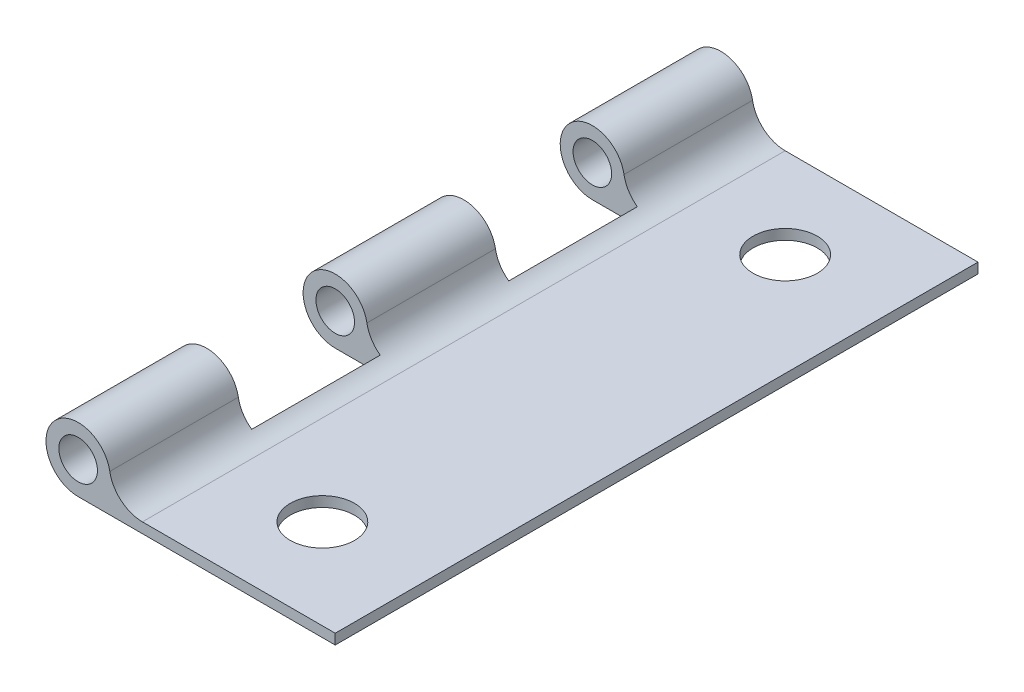
ISO-10303-21;
HEADER;
FILE_DESCRIPTION(('STEP AP214'),'2;1');
FILE_NAME('part.step','',(''),(''),'','','');
FILE_SCHEMA(('AUTOMOTIVE_DESIGN { 1 0 10303 214 1 1 1 1 }'));
ENDSEC;
DATA;
#1=APPLICATION_CONTEXT('core data for automotive mechanical design processes');
#2=APPLICATION_PROTOCOL_DEFINITION('international standard','automotive_design',2000,#1);
#3=PRODUCT_CONTEXT('',#1,'mechanical');
#4=PRODUCT('Part','Part','',(#3));
#5=PRODUCT_RELATED_PRODUCT_CATEGORY('part','',(#4));
#6=PRODUCT_DEFINITION_FORMATION('','',#4);
#7=PRODUCT_DEFINITION_CONTEXT('part definition',#1,'design');
#8=PRODUCT_DEFINITION('design','',#6,#7);
#9=PRODUCT_DEFINITION_SHAPE('','',#8);
#10=(LENGTH_UNIT() NAMED_UNIT(*) SI_UNIT(.MILLI.,.METRE.));
#11=(NAMED_UNIT(*) PLANE_ANGLE_UNIT() SI_UNIT($,.RADIAN.));
#12=(NAMED_UNIT(*) SI_UNIT($,.STERADIAN.) SOLID_ANGLE_UNIT());
#13=UNCERTAINTY_MEASURE_WITH_UNIT(LENGTH_MEASURE(1.E-05),#10,'distance_accuracy_value','');
#14=(GEOMETRIC_REPRESENTATION_CONTEXT(3) GLOBAL_UNCERTAINTY_ASSIGNED_CONTEXT((#13)) GLOBAL_UNIT_ASSIGNED_CONTEXT((#10,
#11,#12)) REPRESENTATION_CONTEXT('',''));
#15=CARTESIAN_POINT('',(0.,0.,0.));
#16=DIRECTION('',(0.,0.,1.));
#17=DIRECTION('',(1.,0.,0.));
#18=AXIS2_PLACEMENT_3D('',#15,#16,#17);
#19=CARTESIAN_POINT('',(-20.,2.50000000000001,50.));
#20=DIRECTION('',(0.,0.,-1.));
#21=DIRECTION('',(-1.,0.,0.));
#22=AXIS2_PLACEMENT_3D('',#19,#20,#21);
#23=CYLINDRICAL_SURFACE('',#22,2.50000000000001);
#24=DIRECTION('',(0.,0.,-1.));
#25=VECTOR('',#24,1.);
#26=CARTESIAN_POINT('',(-20.,0.,50.));
#27=LINE('',#26,#25);
#28=CARTESIAN_POINT('',(-20.,0.,30.));
#29=VERTEX_POINT('',#28);
#30=CARTESIAN_POINT('',(-20.,0.,20.));
#31=VERTEX_POINT('',#30);
#32=EDGE_CURVE('E241',#29,#31,#27,.T.);
#33=ORIENTED_EDGE('',*,*,#32,.F.);
#34=CARTESIAN_POINT('',(-20.,2.50000000000001,30.));
#35=DIRECTION('',(0.,0.,-1.));
#36=DIRECTION('',(-1.,0.,0.));
#37=AXIS2_PLACEMENT_3D('',#34,#35,#36);
#38=CIRCLE('',#37,2.50000000000001);
#39=CARTESIAN_POINT('',(-17.5375234521576,2.93151969981239,30.));
#40=VERTEX_POINT('',#39);
#41=EDGE_CURVE('E188',#29,#40,#38,.T.);
#42=ORIENTED_EDGE('',*,*,#41,.T.);
#43=DIRECTION('',(0.,0.,-1.));
#44=VECTOR('',#43,1.);
#45=CARTESIAN_POINT('',(-17.5375234521576,2.93151969981239,50.));
#46=LINE('',#45,#44);
#47=CARTESIAN_POINT('',(-17.5375234521576,2.93151969981239,20.));
#48=VERTEX_POINT('',#47);
#49=EDGE_CURVE('E245',#40,#48,#46,.T.);
#50=ORIENTED_EDGE('',*,*,#49,.T.);
#51=CARTESIAN_POINT('',(-20.,2.50000000000001,20.));
#52=DIRECTION('',(0.,0.,1.));
#53=DIRECTION('',(1.,0.,0.));
#54=AXIS2_PLACEMENT_3D('',#51,#52,#53);
#55=CIRCLE('',#54,2.50000000000001);
#56=EDGE_CURVE('E179',#48,#31,#55,.T.);
#57=ORIENTED_EDGE('',*,*,#56,.T.);
#58=EDGE_LOOP('',(#33,#42,#50,#57));
#59=FACE_BOUND('',#58,.T.);
#60=ADVANCED_FACE('F33',(#59),#23,.T.);
#61=CARTESIAN_POINT('',(-17.5375234521576,2.93151969981239,50.));
#62=VERTEX_POINT('',#61);
#63=CARTESIAN_POINT('',(-17.5375234521576,2.93151969981239,40.));
#64=VERTEX_POINT('',#63);
#65=EDGE_CURVE('E242',#62,#64,#46,.T.);
#66=ORIENTED_EDGE('',*,*,#65,.T.);
#67=CARTESIAN_POINT('',(-20.,2.50000000000001,40.));
#68=DIRECTION('',(0.,0.,1.));
#69=DIRECTION('',(1.,0.,0.));
#70=AXIS2_PLACEMENT_3D('',#67,#68,#69);
#71=CIRCLE('',#70,2.50000000000001);
#72=CARTESIAN_POINT('',(-20.,0.,40.));
#73=VERTEX_POINT('',#72);
#74=EDGE_CURVE('E185',#64,#73,#71,.T.);
#75=ORIENTED_EDGE('',*,*,#74,.T.);
#76=CARTESIAN_POINT('',(-20.,0.,50.));
#77=VERTEX_POINT('',#76);
#78=EDGE_CURVE('E153',#77,#73,#27,.T.);
#79=ORIENTED_EDGE('',*,*,#78,.F.);
#80=CARTESIAN_POINT('',(-20.,2.50000000000001,50.));
#81=DIRECTION('',(0.,0.,1.));
#82=DIRECTION('',(-1.,0.,0.));
#83=AXIS2_PLACEMENT_3D('',#80,#81,#82);
#84=CIRCLE('',#83,2.5);
#85=EDGE_CURVE('E220',#62,#77,#84,.T.);
#86=ORIENTED_EDGE('',*,*,#85,.F.);
#87=EDGE_LOOP('',(#66,#75,#79,#86));
#88=FACE_BOUND('',#87,.T.);
#89=ADVANCED_FACE('F259',(#88),#23,.T.);
#90=CARTESIAN_POINT('',(-20.,2.50000000000001,50.));
#91=DIRECTION('',(0.,0.,-1.));
#92=DIRECTION('',(-1.,0.,0.));
#93=AXIS2_PLACEMENT_3D('',#90,#91,#92);
#94=CYLINDRICAL_SURFACE('',#93,1.5);
#95=CARTESIAN_POINT('',(-20.,2.50000000000001,40.));
#96=DIRECTION('',(0.,0.,1.));
#97=DIRECTION('',(1.,0.,0.));
#98=AXIS2_PLACEMENT_3D('',#95,#96,#97);
#99=CIRCLE('',#98,1.5);
#100=CARTESIAN_POINT('',(-18.5,2.50000000000001,40.));
#101=VERTEX_POINT('',#100);
#102=EDGE_CURVE('E184',#101,#101,#99,.T.);
#103=ORIENTED_EDGE('',*,*,#102,.F.);
#104=EDGE_LOOP('',(#103));
#105=FACE_BOUND('',#104,.T.);
#106=CARTESIAN_POINT('',(-20.,2.50000000000001,50.));
#107=DIRECTION('',(0.,0.,1.));
#108=DIRECTION('',(1.,0.,0.));
#109=AXIS2_PLACEMENT_3D('',#106,#107,#108);
#110=CIRCLE('',#109,1.5);
#111=CARTESIAN_POINT('',(-18.5,2.50000000000001,50.));
#112=VERTEX_POINT('',#111);
#113=EDGE_CURVE('E206',#112,#112,#110,.T.);
#114=ORIENTED_EDGE('',*,*,#113,.T.);
#115=EDGE_LOOP('',(#114));
#116=FACE_BOUND('',#115,.T.);
#117=ADVANCED_FACE('F255',(#105,#116),#94,.F.);
#118=CARTESIAN_POINT('',(-20.,2.50000000000001,50.));
#119=DIRECTION('',(0.,0.,-1.));
#120=DIRECTION('',(-1.,0.,0.));
#121=AXIS2_PLACEMENT_3D('',#118,#119,#120);
#122=PLANE('',#121);
#123=DIRECTION('',(0.,1.,0.));
#124=VECTOR('',#123,1.);
#125=CARTESIAN_POINT('',(0.,0.799999999999994,50.));
#126=LINE('',#125,#124);
#127=CARTESIAN_POINT('',(0.,0.,50.));
#128=VERTEX_POINT('',#127);
#129=CARTESIAN_POINT('',(0.,0.799999999999994,50.));
#130=VERTEX_POINT('',#129);
#131=EDGE_CURVE('E212',#128,#130,#126,.T.);
#132=ORIENTED_EDGE('',*,*,#131,.T.);
#133=DIRECTION('',(-1.,0.,0.));
#134=VECTOR('',#133,1.);
#135=CARTESIAN_POINT('',(-15.,0.799999999999999,50.));
#136=LINE('',#135,#134);
#137=CARTESIAN_POINT('',(-15.,0.799999999999999,50.));
#138=VERTEX_POINT('',#137);
#139=EDGE_CURVE('E215',#130,#138,#136,.T.);
#140=ORIENTED_EDGE('',*,*,#139,.T.);
#141=CARTESIAN_POINT('',(-15.,3.37619047619047,50.));
#142=DIRECTION('',(0.,0.,-1.));
#143=DIRECTION('',(1.,0.,0.));
#144=AXIS2_PLACEMENT_3D('',#141,#142,#143);
#145=CIRCLE('',#144,2.57619047619047);
#146=EDGE_CURVE('E218',#138,#62,#145,.T.);
#147=ORIENTED_EDGE('',*,*,#146,.T.);
#148=ORIENTED_EDGE('',*,*,#85,.T.);
#149=DIRECTION('',(1.,0.,0.));
#150=VECTOR('',#149,1.);
#151=CARTESIAN_POINT('',(0.,0.,50.));
#152=LINE('',#151,#150);
#153=EDGE_CURVE('E222',#77,#128,#152,.T.);
#154=ORIENTED_EDGE('',*,*,#153,.T.);
#155=EDGE_LOOP('',(#132,#140,#147,#148,#154));
#156=FACE_BOUND('',#155,.T.);
#157=ORIENTED_EDGE('',*,*,#113,.F.);
#158=EDGE_LOOP('',(#157));
#159=FACE_BOUND('',#158,.T.);
#160=ADVANCED_FACE('F258',(#156,#159),#122,.F.);
#161=CARTESIAN_POINT('',(-20.,2.50000000000001,0.));
#162=DIRECTION('',(0.,0.,-1.));
#163=DIRECTION('',(-1.,0.,0.));
#164=AXIS2_PLACEMENT_3D('',#161,#162,#163);
#165=PLANE('',#164);
#166=DIRECTION('',(0.,1.,0.));
#167=VECTOR('',#166,1.);
#168=CARTESIAN_POINT('',(0.,0.799999999999994,0.));
#169=LINE('',#168,#167);
#170=CARTESIAN_POINT('',(0.,0.,0.));
#171=VERTEX_POINT('',#170);
#172=CARTESIAN_POINT('',(0.,0.799999999999994,0.));
#173=VERTEX_POINT('',#172);
#174=EDGE_CURVE('E209',#171,#173,#169,.T.);
#175=ORIENTED_EDGE('',*,*,#174,.F.);
#176=DIRECTION('',(1.,0.,0.));
#177=VECTOR('',#176,1.);
#178=CARTESIAN_POINT('',(0.,0.,0.));
#179=LINE('',#178,#177);
#180=CARTESIAN_POINT('',(-20.,0.,0.));
#181=VERTEX_POINT('',#180);
#182=EDGE_CURVE('E216',#181,#171,#179,.T.);
#183=ORIENTED_EDGE('',*,*,#182,.F.);
#184=CARTESIAN_POINT('',(-20.,2.50000000000001,0.));
#185=DIRECTION('',(0.,0.,1.));
#186=DIRECTION('',(-1.,0.,0.));
#187=AXIS2_PLACEMENT_3D('',#184,#185,#186);
#188=CIRCLE('',#187,2.50000000000001);
#189=CARTESIAN_POINT('',(-17.5375234521576,2.93151969981239,0.));
#190=VERTEX_POINT('',#189);
#191=EDGE_CURVE('E232',#190,#181,#188,.T.);
#192=ORIENTED_EDGE('',*,*,#191,.F.);
#193=CARTESIAN_POINT('',(-15.,3.37619047619047,0.));
#194=DIRECTION('',(0.,0.,-1.));
#195=DIRECTION('',(1.,0.,0.));
#196=AXIS2_PLACEMENT_3D('',#193,#194,#195);
#197=CIRCLE('',#196,2.57619047619047);
#198=CARTESIAN_POINT('',(-15.,0.799999999999999,0.));
#199=VERTEX_POINT('',#198);
#200=EDGE_CURVE('E229',#199,#190,#197,.T.);
#201=ORIENTED_EDGE('',*,*,#200,.F.);
#202=DIRECTION('',(-1.,0.,0.));
#203=VECTOR('',#202,1.);
#204=CARTESIAN_POINT('',(-15.,0.799999999999999,0.));
#205=LINE('',#204,#203);
#206=EDGE_CURVE('E227',#173,#199,#205,.T.);
#207=ORIENTED_EDGE('',*,*,#206,.F.);
#208=EDGE_LOOP('',(#175,#183,#192,#201,#207));
#209=FACE_BOUND('',#208,.T.);
#210=CARTESIAN_POINT('',(-20.,2.50000000000001,0.));
#211=DIRECTION('',(0.,0.,1.));
#212=DIRECTION('',(1.,0.,0.));
#213=AXIS2_PLACEMENT_3D('',#210,#211,#212);
#214=CIRCLE('',#213,1.5);
#215=CARTESIAN_POINT('',(-18.5,2.50000000000001,0.));
#216=VERTEX_POINT('',#215);
#217=EDGE_CURVE('E205',#216,#216,#214,.T.);
#218=ORIENTED_EDGE('',*,*,#217,.T.);
#219=EDGE_LOOP('',(#218));
#220=FACE_BOUND('',#219,.T.);
#221=ADVANCED_FACE('F266',(#209,#220),#165,.T.);
#222=CARTESIAN_POINT('',(0.,0.799999999999994,50.));
#223=DIRECTION('',(-1.,0.,0.));
#224=DIRECTION('',(0.,-1.,0.));
#225=AXIS2_PLACEMENT_3D('',#222,#223,#224);
#226=PLANE('',#225);
#227=ORIENTED_EDGE('',*,*,#174,.T.);
#228=DIRECTION('',(0.,0.,-1.));
#229=VECTOR('',#228,1.);
#230=CARTESIAN_POINT('',(0.,0.799999999999994,50.));
#231=LINE('',#230,#229);
#232=EDGE_CURVE('E11',#130,#173,#231,.T.);
#233=ORIENTED_EDGE('',*,*,#232,.F.);
#234=ORIENTED_EDGE('',*,*,#131,.F.);
#235=DIRECTION('',(0.,0.,-1.));
#236=VECTOR('',#235,1.);
#237=CARTESIAN_POINT('',(0.,0.,50.));
#238=LINE('',#237,#236);
#239=EDGE_CURVE('E224',#128,#171,#238,.T.);
#240=ORIENTED_EDGE('',*,*,#239,.T.);
#241=EDGE_LOOP('',(#227,#233,#234,#240));
#242=FACE_BOUND('',#241,.T.);
#243=ADVANCED_FACE('F35',(#242),#226,.F.);
#244=CARTESIAN_POINT('',(-15.,0.799999999999999,50.));
#245=DIRECTION('',(0.,-1.,0.));
#246=DIRECTION('',(1.,0.,0.));
#247=AXIS2_PLACEMENT_3D('',#244,#245,#246);
#248=PLANE('',#247);
#249=CARTESIAN_POINT('',(-7.99999999999999,0.799999999999997,7.));
#250=DIRECTION('',(0.,-1.,0.));
#251=DIRECTION('',(1.,0.,0.));
#252=AXIS2_PLACEMENT_3D('',#249,#250,#251);
#253=CIRCLE('',#252,2.5);
#254=CARTESIAN_POINT('',(-5.49999999999999,0.799999999999996,7.));
#255=VERTEX_POINT('',#254);
#256=EDGE_CURVE('E202',#255,#255,#253,.T.);
#257=ORIENTED_EDGE('',*,*,#256,.T.);
#258=EDGE_LOOP('',(#257));
#259=FACE_BOUND('',#258,.T.);
#260=CARTESIAN_POINT('',(-8.,0.799999999999997,43.));
#261=DIRECTION('',(0.,-1.,0.));
#262=DIRECTION('',(1.,0.,0.));
#263=AXIS2_PLACEMENT_3D('',#260,#261,#262);
#264=CIRCLE('',#263,2.5);
#265=CARTESIAN_POINT('',(-5.5,0.799999999999996,43.));
#266=VERTEX_POINT('',#265);
#267=EDGE_CURVE('E197',#266,#266,#264,.T.);
#268=ORIENTED_EDGE('',*,*,#267,.T.);
#269=EDGE_LOOP('',(#268));
#270=FACE_BOUND('',#269,.T.);
#271=ORIENTED_EDGE('',*,*,#206,.T.);
#272=DIRECTION('',(0.,0.,-1.));
#273=VECTOR('',#272,1.);
#274=CARTESIAN_POINT('',(-15.,0.799999999999999,50.));
#275=LINE('',#274,#273);
#276=EDGE_CURVE('E42',#138,#199,#275,.T.);
#277=ORIENTED_EDGE('',*,*,#276,.F.);
#278=ORIENTED_EDGE('',*,*,#139,.F.);
#279=ORIENTED_EDGE('',*,*,#232,.T.);
#280=EDGE_LOOP('',(#271,#277,#278,#279));
#281=FACE_BOUND('',#280,.T.);
#282=ADVANCED_FACE('F293',(#259,#270,#281),#248,.F.);
#283=CARTESIAN_POINT('',(-15.,3.37619047619047,50.));
#284=DIRECTION('',(0.,0.,-1.));
#285=DIRECTION('',(-1.,0.,0.));
#286=AXIS2_PLACEMENT_3D('',#283,#284,#285);
#287=CYLINDRICAL_SURFACE('',#286,2.57619047619047);
#288=ORIENTED_EDGE('',*,*,#49,.F.);
#289=CARTESIAN_POINT('',(-15.,3.37619047619047,30.));
#290=DIRECTION('',(0.,0.,-1.));
#291=DIRECTION('',(-1.,0.,0.));
#292=AXIS2_PLACEMENT_3D('',#289,#290,#291);
#293=CIRCLE('',#292,2.57619047619047);
#294=CARTESIAN_POINT('',(-16.5,1.28173174668194,30.));
#295=VERTEX_POINT('',#294);
#296=EDGE_CURVE('E191',#40,#295,#293,.F.);
#297=ORIENTED_EDGE('',*,*,#296,.T.);
#298=DIRECTION('',(0.,0.,-1.));
#299=VECTOR('',#298,1.);
#300=CARTESIAN_POINT('',(-16.5,1.28173174668194,50.));
#301=LINE('',#300,#299);
#302=CARTESIAN_POINT('',(-16.5,1.28173174668194,40.));
#303=VERTEX_POINT('',#302);
#304=EDGE_CURVE('E200',#295,#303,#301,.F.);
#305=ORIENTED_EDGE('',*,*,#304,.T.);
#306=CARTESIAN_POINT('',(-15.,3.37619047619047,40.));
#307=DIRECTION('',(0.,0.,1.));
#308=DIRECTION('',(1.,0.,0.));
#309=AXIS2_PLACEMENT_3D('',#306,#307,#308);
#310=CIRCLE('',#309,2.57619047619047);
#311=EDGE_CURVE('E139',#303,#64,#310,.F.);
#312=ORIENTED_EDGE('',*,*,#311,.T.);
#313=ORIENTED_EDGE('',*,*,#65,.F.);
#314=ORIENTED_EDGE('',*,*,#146,.F.);
#315=ORIENTED_EDGE('',*,*,#276,.T.);
#316=ORIENTED_EDGE('',*,*,#200,.T.);
#317=CARTESIAN_POINT('',(-17.5375234521576,2.93151969981239,10.));
#318=VERTEX_POINT('',#317);
#319=EDGE_CURVE('E240',#318,#190,#46,.T.);
#320=ORIENTED_EDGE('',*,*,#319,.F.);
#321=CARTESIAN_POINT('',(-15.,3.37619047619047,10.));
#322=DIRECTION('',(0.,0.,-1.));
#323=DIRECTION('',(-1.,0.,0.));
#324=AXIS2_PLACEMENT_3D('',#321,#322,#323);
#325=CIRCLE('',#324,2.57619047619047);
#326=CARTESIAN_POINT('',(-16.5,1.28173174668194,10.));
#327=VERTEX_POINT('',#326);
#328=EDGE_CURVE('E175',#318,#327,#325,.F.);
#329=ORIENTED_EDGE('',*,*,#328,.T.);
#330=DIRECTION('',(0.,0.,-1.));
#331=VECTOR('',#330,1.);
#332=CARTESIAN_POINT('',(-16.5,1.28173174668194,50.));
#333=LINE('',#332,#331);
#334=CARTESIAN_POINT('',(-16.5,1.28173174668194,20.));
#335=VERTEX_POINT('',#334);
#336=EDGE_CURVE('E194',#327,#335,#333,.F.);
#337=ORIENTED_EDGE('',*,*,#336,.T.);
#338=CARTESIAN_POINT('',(-15.,3.37619047619047,20.));
#339=DIRECTION('',(0.,0.,1.));
#340=DIRECTION('',(1.,0.,0.));
#341=AXIS2_PLACEMENT_3D('',#338,#339,#340);
#342=CIRCLE('',#341,2.57619047619047);
#343=EDGE_CURVE('E181',#335,#48,#342,.F.);
#344=ORIENTED_EDGE('',*,*,#343,.T.);
#345=EDGE_LOOP('',(#288,#297,#305,#312,#313,#314,#315,#316,#320,#329,#337,#344));
#346=FACE_BOUND('',#345,.T.);
#347=ADVANCED_FACE('F286',(#346),#287,.F.);
#348=CARTESIAN_POINT('',(-20.,0.,10.));
#349=VERTEX_POINT('',#348);
#350=EDGE_CURVE('E238',#349,#181,#27,.T.);
#351=ORIENTED_EDGE('',*,*,#350,.F.);
#352=CARTESIAN_POINT('',(-20.,2.50000000000001,10.));
#353=DIRECTION('',(0.,0.,-1.));
#354=DIRECTION('',(-1.,0.,0.));
#355=AXIS2_PLACEMENT_3D('',#352,#353,#354);
#356=CIRCLE('',#355,2.50000000000001);
#357=EDGE_CURVE('E58',#349,#318,#356,.T.);
#358=ORIENTED_EDGE('',*,*,#357,.T.);
#359=ORIENTED_EDGE('',*,*,#319,.T.);
#360=ORIENTED_EDGE('',*,*,#191,.T.);
#361=EDGE_LOOP('',(#351,#358,#359,#360));
#362=FACE_BOUND('',#361,.T.);
#363=ADVANCED_FACE('F277',(#362),#23,.T.);
#364=CARTESIAN_POINT('',(0.,0.,50.));
#365=DIRECTION('',(0.,1.,0.));
#366=DIRECTION('',(-1.,0.,0.));
#367=AXIS2_PLACEMENT_3D('',#364,#365,#366);
#368=PLANE('',#367);
#369=CARTESIAN_POINT('',(-7.99999999999999,0.,7.));
#370=DIRECTION('',(0.,-1.,0.));
#371=DIRECTION('',(-1.,0.,0.));
#372=AXIS2_PLACEMENT_3D('',#369,#370,#371);
#373=CIRCLE('',#372,2.5);
#374=CARTESIAN_POINT('',(-10.5,0.,7.));
#375=VERTEX_POINT('',#374);
#376=EDGE_CURVE('E158',#375,#375,#373,.T.);
#377=ORIENTED_EDGE('',*,*,#376,.F.);
#378=EDGE_LOOP('',(#377));
#379=FACE_BOUND('',#378,.T.);
#380=CARTESIAN_POINT('',(-8.,0.,43.));
#381=DIRECTION('',(0.,-1.,0.));
#382=DIRECTION('',(1.,0.,0.));
#383=AXIS2_PLACEMENT_3D('',#380,#381,#382);
#384=CIRCLE('',#383,2.5);
#385=CARTESIAN_POINT('',(-5.5,0.,43.));
#386=VERTEX_POINT('',#385);
#387=EDGE_CURVE('E142',#386,#386,#384,.T.);
#388=ORIENTED_EDGE('',*,*,#387,.F.);
#389=EDGE_LOOP('',(#388));
#390=FACE_BOUND('',#389,.T.);
#391=DIRECTION('',(0.,0.,1.));
#392=VECTOR('',#391,1.);
#393=CARTESIAN_POINT('',(-16.5,0.,30.));
#394=LINE('',#393,#392);
#395=CARTESIAN_POINT('',(-16.5,0.,30.));
#396=VERTEX_POINT('',#395);
#397=CARTESIAN_POINT('',(-16.5,0.,40.));
#398=VERTEX_POINT('',#397);
#399=EDGE_CURVE('E146',#396,#398,#394,.T.);
#400=ORIENTED_EDGE('',*,*,#399,.F.);
#401=DIRECTION('',(1.,0.,0.));
#402=VECTOR('',#401,1.);
#403=CARTESIAN_POINT('',(-22.5,0.,30.));
#404=LINE('',#403,#402);
#405=EDGE_CURVE('E50',#29,#396,#404,.T.);
#406=ORIENTED_EDGE('',*,*,#405,.F.);
#407=ORIENTED_EDGE('',*,*,#32,.T.);
#408=DIRECTION('',(-1.,0.,0.));
#409=VECTOR('',#408,1.);
#410=CARTESIAN_POINT('',(-22.5,0.,20.));
#411=LINE('',#410,#409);
#412=CARTESIAN_POINT('',(-16.5,0.,20.));
#413=VERTEX_POINT('',#412);
#414=EDGE_CURVE('E166',#413,#31,#411,.T.);
#415=ORIENTED_EDGE('',*,*,#414,.F.);
#416=DIRECTION('',(0.,0.,1.));
#417=VECTOR('',#416,1.);
#418=CARTESIAN_POINT('',(-16.5,0.,10.));
#419=LINE('',#418,#417);
#420=CARTESIAN_POINT('',(-16.5,0.,10.));
#421=VERTEX_POINT('',#420);
#422=EDGE_CURVE('E163',#421,#413,#419,.T.);
#423=ORIENTED_EDGE('',*,*,#422,.F.);
#424=DIRECTION('',(1.,0.,0.));
#425=VECTOR('',#424,1.);
#426=CARTESIAN_POINT('',(-22.5,0.,10.));
#427=LINE('',#426,#425);
#428=EDGE_CURVE('E161',#349,#421,#427,.T.);
#429=ORIENTED_EDGE('',*,*,#428,.F.);
#430=ORIENTED_EDGE('',*,*,#350,.T.);
#431=ORIENTED_EDGE('',*,*,#182,.T.);
#432=ORIENTED_EDGE('',*,*,#239,.F.);
#433=ORIENTED_EDGE('',*,*,#153,.F.);
#434=ORIENTED_EDGE('',*,*,#78,.T.);
#435=DIRECTION('',(-1.,0.,0.));
#436=VECTOR('',#435,1.);
#437=CARTESIAN_POINT('',(-22.5,0.,40.));
#438=LINE('',#437,#436);
#439=EDGE_CURVE('E136',#398,#73,#438,.T.);
#440=ORIENTED_EDGE('',*,*,#439,.F.);
#441=EDGE_LOOP('',(#400,#406,#407,#415,#423,#429,#430,#431,#432,#433,#434,#440));
#442=FACE_BOUND('',#441,.T.);
#443=ADVANCED_FACE('F150',(#379,#390,#442),#368,.F.);
#444=CARTESIAN_POINT('',(-20.,2.50000000000001,10.));
#445=DIRECTION('',(0.,0.,-1.));
#446=DIRECTION('',(-1.,0.,0.));
#447=AXIS2_PLACEMENT_3D('',#444,#445,#446);
#448=CIRCLE('',#447,1.5);
#449=CARTESIAN_POINT('',(-21.5,2.50000000000001,10.));
#450=VERTEX_POINT('',#449);
#451=EDGE_CURVE('E172',#450,#450,#448,.T.);
#452=ORIENTED_EDGE('',*,*,#451,.F.);
#453=EDGE_LOOP('',(#452));
#454=FACE_BOUND('',#453,.T.);
#455=ORIENTED_EDGE('',*,*,#217,.F.);
#456=EDGE_LOOP('',(#455));
#457=FACE_BOUND('',#456,.T.);
#458=ADVANCED_FACE('F261',(#454,#457),#94,.F.);
#459=CARTESIAN_POINT('',(-16.5,5.00000000000002,10.));
#460=DIRECTION('',(1.,0.,0.));
#461=DIRECTION('',(0.,1.,0.));
#462=AXIS2_PLACEMENT_3D('',#459,#460,#461);
#463=PLANE('',#462);
#464=DIRECTION('',(0.,-1.,0.));
#465=VECTOR('',#464,1.);
#466=CARTESIAN_POINT('',(-16.5,5.00000000000002,10.));
#467=LINE('',#466,#465);
#468=EDGE_CURVE('E169',#327,#421,#467,.T.);
#469=ORIENTED_EDGE('',*,*,#468,.T.);
#470=ORIENTED_EDGE('',*,*,#422,.T.);
#471=DIRECTION('',(0.,-1.,0.));
#472=VECTOR('',#471,1.);
#473=CARTESIAN_POINT('',(-16.5,5.00000000000002,20.));
#474=LINE('',#473,#472);
#475=EDGE_CURVE('E170',#335,#413,#474,.T.);
#476=ORIENTED_EDGE('',*,*,#475,.F.);
#477=ORIENTED_EDGE('',*,*,#336,.F.);
#478=EDGE_LOOP('',(#469,#470,#476,#477));
#479=FACE_BOUND('',#478,.T.);
#480=ADVANCED_FACE('F308',(#479),#463,.F.);
#481=CARTESIAN_POINT('',(-22.5,5.00000000000002,20.));
#482=DIRECTION('',(0.,0.,1.));
#483=DIRECTION('',(1.,0.,0.));
#484=AXIS2_PLACEMENT_3D('',#481,#482,#483);
#485=PLANE('',#484);
#486=CARTESIAN_POINT('',(-20.,2.50000000000001,20.));
#487=DIRECTION('',(0.,0.,1.));
#488=DIRECTION('',(1.,0.,0.));
#489=AXIS2_PLACEMENT_3D('',#486,#487,#488);
#490=CIRCLE('',#489,1.5);
#491=CARTESIAN_POINT('',(-18.5,2.50000000000001,20.));
#492=VERTEX_POINT('',#491);
#493=EDGE_CURVE('E178',#492,#492,#490,.T.);
#494=ORIENTED_EDGE('',*,*,#493,.T.);
#495=EDGE_LOOP('',(#494));
#496=FACE_BOUND('',#495,.T.);
#497=ORIENTED_EDGE('',*,*,#56,.F.);
#498=ORIENTED_EDGE('',*,*,#343,.F.);
#499=ORIENTED_EDGE('',*,*,#475,.T.);
#500=ORIENTED_EDGE('',*,*,#414,.T.);
#501=EDGE_LOOP('',(#497,#498,#499,#500));
#502=FACE_BOUND('',#501,.T.);
#503=ADVANCED_FACE('F305',(#496,#502),#485,.F.);
#504=CARTESIAN_POINT('',(-22.5,5.00000000000002,10.));
#505=DIRECTION('',(0.,0.,-1.));
#506=DIRECTION('',(-1.,0.,0.));
#507=AXIS2_PLACEMENT_3D('',#504,#505,#506);
#508=PLANE('',#507);
#509=ORIENTED_EDGE('',*,*,#451,.T.);
#510=EDGE_LOOP('',(#509));
#511=FACE_BOUND('',#510,.T.);
#512=ORIENTED_EDGE('',*,*,#357,.F.);
#513=ORIENTED_EDGE('',*,*,#428,.T.);
#514=ORIENTED_EDGE('',*,*,#468,.F.);
#515=ORIENTED_EDGE('',*,*,#328,.F.);
#516=EDGE_LOOP('',(#512,#513,#514,#515));
#517=FACE_BOUND('',#516,.T.);
#518=ADVANCED_FACE('F310',(#511,#517),#508,.F.);
#519=CARTESIAN_POINT('',(-20.,2.50000000000001,30.));
#520=DIRECTION('',(0.,0.,-1.));
#521=DIRECTION('',(-1.,0.,0.));
#522=AXIS2_PLACEMENT_3D('',#519,#520,#521);
#523=CIRCLE('',#522,1.5);
#524=CARTESIAN_POINT('',(-21.5,2.50000000000001,30.));
#525=VERTEX_POINT('',#524);
#526=EDGE_CURVE('E37',#525,#525,#523,.T.);
#527=ORIENTED_EDGE('',*,*,#526,.F.);
#528=EDGE_LOOP('',(#527));
#529=FACE_BOUND('',#528,.T.);
#530=ORIENTED_EDGE('',*,*,#493,.F.);
#531=EDGE_LOOP('',(#530));
#532=FACE_BOUND('',#531,.T.);
#533=ADVANCED_FACE('F262',(#529,#532),#94,.F.);
#534=CARTESIAN_POINT('',(-16.5,5.00000000000002,30.));
#535=DIRECTION('',(1.,0.,0.));
#536=DIRECTION('',(0.,1.,0.));
#537=AXIS2_PLACEMENT_3D('',#534,#535,#536);
#538=PLANE('',#537);
#539=DIRECTION('',(0.,-1.,0.));
#540=VECTOR('',#539,1.);
#541=CARTESIAN_POINT('',(-16.5,5.00000000000002,30.));
#542=LINE('',#541,#540);
#543=EDGE_CURVE('E143',#295,#396,#542,.T.);
#544=ORIENTED_EDGE('',*,*,#543,.T.);
#545=ORIENTED_EDGE('',*,*,#399,.T.);
#546=DIRECTION('',(0.,-1.,0.));
#547=VECTOR('',#546,1.);
#548=CARTESIAN_POINT('',(-16.5,5.00000000000002,40.));
#549=LINE('',#548,#547);
#550=EDGE_CURVE('E132',#303,#398,#549,.T.);
#551=ORIENTED_EDGE('',*,*,#550,.F.);
#552=ORIENTED_EDGE('',*,*,#304,.F.);
#553=EDGE_LOOP('',(#544,#545,#551,#552));
#554=FACE_BOUND('',#553,.T.);
#555=ADVANCED_FACE('F147',(#554),#538,.F.);
#556=CARTESIAN_POINT('',(-22.5,5.00000000000002,30.));
#557=DIRECTION('',(0.,0.,-1.));
#558=DIRECTION('',(-1.,0.,0.));
#559=AXIS2_PLACEMENT_3D('',#556,#557,#558);
#560=PLANE('',#559);
#561=ORIENTED_EDGE('',*,*,#526,.T.);
#562=EDGE_LOOP('',(#561));
#563=FACE_BOUND('',#562,.T.);
#564=ORIENTED_EDGE('',*,*,#41,.F.);
#565=ORIENTED_EDGE('',*,*,#405,.T.);
#566=ORIENTED_EDGE('',*,*,#543,.F.);
#567=ORIENTED_EDGE('',*,*,#296,.F.);
#568=EDGE_LOOP('',(#564,#565,#566,#567));
#569=FACE_BOUND('',#568,.T.);
#570=ADVANCED_FACE('F322',(#563,#569),#560,.F.);
#571=CARTESIAN_POINT('',(-22.5,5.00000000000002,40.));
#572=DIRECTION('',(0.,0.,1.));
#573=DIRECTION('',(1.,0.,0.));
#574=AXIS2_PLACEMENT_3D('',#571,#572,#573);
#575=PLANE('',#574);
#576=ORIENTED_EDGE('',*,*,#102,.T.);
#577=EDGE_LOOP('',(#576));
#578=FACE_BOUND('',#577,.T.);
#579=ORIENTED_EDGE('',*,*,#74,.F.);
#580=ORIENTED_EDGE('',*,*,#311,.F.);
#581=ORIENTED_EDGE('',*,*,#550,.T.);
#582=ORIENTED_EDGE('',*,*,#439,.T.);
#583=EDGE_LOOP('',(#579,#580,#581,#582));
#584=FACE_BOUND('',#583,.T.);
#585=ADVANCED_FACE('F134',(#578,#584),#575,.F.);
#586=CARTESIAN_POINT('',(-8.,5.00000000000002,43.));
#587=DIRECTION('',(0.,-1.,0.));
#588=DIRECTION('',(1.,0.,0.));
#589=AXIS2_PLACEMENT_3D('',#586,#587,#588);
#590=CYLINDRICAL_SURFACE('',#589,2.5);
#591=ORIENTED_EDGE('',*,*,#387,.T.);
#592=EDGE_LOOP('',(#591));
#593=FACE_BOUND('',#592,.T.);
#594=ORIENTED_EDGE('',*,*,#267,.F.);
#595=EDGE_LOOP('',(#594));
#596=FACE_BOUND('',#595,.T.);
#597=ADVANCED_FACE('F330',(#593,#596),#590,.F.);
#598=CARTESIAN_POINT('',(-7.99999999999999,5.00000000000002,7.));
#599=DIRECTION('',(0.,-1.,0.));
#600=DIRECTION('',(1.,0.,0.));
#601=AXIS2_PLACEMENT_3D('',#598,#599,#600);
#602=CYLINDRICAL_SURFACE('',#601,2.5);
#603=ORIENTED_EDGE('',*,*,#376,.T.);
#604=EDGE_LOOP('',(#603));
#605=FACE_BOUND('',#604,.T.);
#606=ORIENTED_EDGE('',*,*,#256,.F.);
#607=EDGE_LOOP('',(#606));
#608=FACE_BOUND('',#607,.T.);
#609=ADVANCED_FACE('F335',(#605,#608),#602,.F.);
#610=CLOSED_SHELL('',(#60,#89,#117,#160,#221,#243,#282,#347,#363,#443,#458,#480,#503,#518,#533,
#555,#570,#585,#597,#609));
#611=MANIFOLD_SOLID_BREP('B2',#610);
#612=ADVANCED_BREP_SHAPE_REPRESENTATION('',(#18,#611),#14);
#613=SHAPE_DEFINITION_REPRESENTATION(#9,#612);
ENDSEC;
END-ISO-10303-21;
